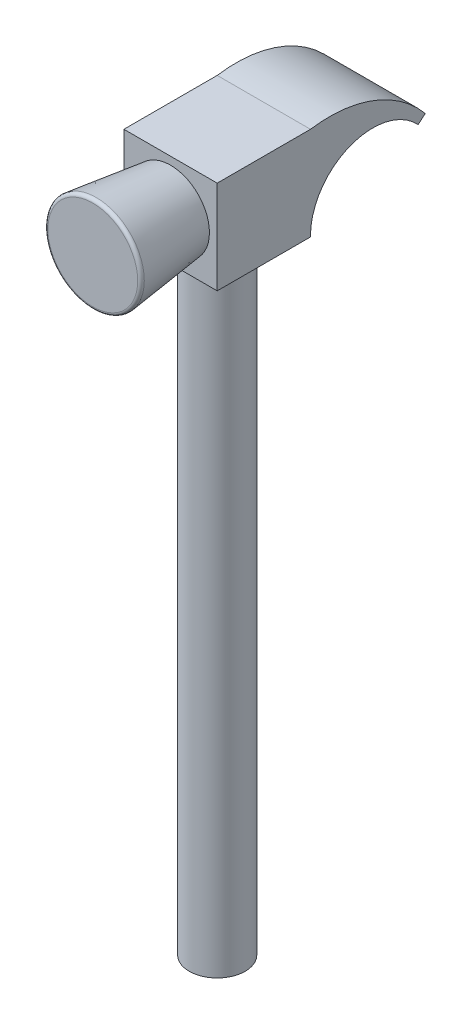
ISO-10303-21;
HEADER;
FILE_DESCRIPTION(('STEP AP214'),'2;1');
FILE_NAME('part.step','',(''),(''),'','','');
FILE_SCHEMA(('AUTOMOTIVE_DESIGN { 1 0 10303 214 1 1 1 1 }'));
ENDSEC;
DATA;
#1=APPLICATION_CONTEXT('core data for automotive mechanical design processes');
#2=APPLICATION_PROTOCOL_DEFINITION('international standard','automotive_design',2000,#1);
#3=PRODUCT_CONTEXT('',#1,'mechanical');
#4=PRODUCT('Part','Part','',(#3));
#5=PRODUCT_RELATED_PRODUCT_CATEGORY('part','',(#4));
#6=PRODUCT_DEFINITION_FORMATION('','',#4);
#7=PRODUCT_DEFINITION_CONTEXT('part definition',#1,'design');
#8=PRODUCT_DEFINITION('design','',#6,#7);
#9=PRODUCT_DEFINITION_SHAPE('','',#8);
#10=(LENGTH_UNIT() NAMED_UNIT(*) SI_UNIT(.MILLI.,.METRE.));
#11=(NAMED_UNIT(*) PLANE_ANGLE_UNIT() SI_UNIT($,.RADIAN.));
#12=(NAMED_UNIT(*) SI_UNIT($,.STERADIAN.) SOLID_ANGLE_UNIT());
#13=UNCERTAINTY_MEASURE_WITH_UNIT(LENGTH_MEASURE(1.E-05),#10,'distance_accuracy_value','');
#14=(GEOMETRIC_REPRESENTATION_CONTEXT(3) GLOBAL_UNCERTAINTY_ASSIGNED_CONTEXT((#13)) GLOBAL_UNIT_ASSIGNED_CONTEXT((#10,
#11,#12)) REPRESENTATION_CONTEXT('',''));
#15=CARTESIAN_POINT('',(0.,0.,0.));
#16=DIRECTION('',(0.,0.,1.));
#17=DIRECTION('',(1.,0.,0.));
#18=AXIS2_PLACEMENT_3D('',#15,#16,#17);
#19=CARTESIAN_POINT('',(0.,200.,0.));
#20=DIRECTION('',(0.,-1.,0.));
#21=DIRECTION('',(0.,0.,-1.));
#22=AXIS2_PLACEMENT_3D('',#19,#20,#21);
#23=CYLINDRICAL_SURFACE('',#22,9.);
#24=CARTESIAN_POINT('',(0.,200.,0.));
#25=DIRECTION('',(0.,1.,0.));
#26=DIRECTION('',(0.,0.,1.));
#27=AXIS2_PLACEMENT_3D('',#24,#25,#26);
#28=CIRCLE('',#27,9.);
#29=CARTESIAN_POINT('',(0.,200.,9.));
#30=VERTEX_POINT('',#29);
#31=EDGE_CURVE('E133',#30,#30,#28,.T.);
#32=ORIENTED_EDGE('',*,*,#31,.F.);
#33=EDGE_LOOP('',(#32));
#34=FACE_BOUND('',#33,.T.);
#35=CARTESIAN_POINT('',(0.,0.,0.));
#36=DIRECTION('',(0.,1.,0.));
#37=DIRECTION('',(0.,0.,1.));
#38=AXIS2_PLACEMENT_3D('',#35,#36,#37);
#39=CIRCLE('',#38,9.);
#40=CARTESIAN_POINT('',(0.,0.,9.));
#41=VERTEX_POINT('',#40);
#42=EDGE_CURVE('E132',#41,#41,#39,.T.);
#43=ORIENTED_EDGE('',*,*,#42,.T.);
#44=EDGE_LOOP('',(#43));
#45=FACE_BOUND('',#44,.T.);
#46=ADVANCED_FACE('F41',(#34,#45),#23,.T.);
#47=CARTESIAN_POINT('',(0.,0.,0.));
#48=DIRECTION('',(0.,1.,0.));
#49=DIRECTION('',(0.,0.,1.));
#50=AXIS2_PLACEMENT_3D('',#47,#48,#49);
#51=PLANE('',#50);
#52=ORIENTED_EDGE('',*,*,#42,.F.);
#53=EDGE_LOOP('',(#52));
#54=FACE_BOUND('',#53,.T.);
#55=ADVANCED_FACE('F227',(#54),#51,.F.);
#56=CARTESIAN_POINT('',(15.,230.,15.));
#57=DIRECTION('',(-1.,0.,0.));
#58=DIRECTION('',(0.,0.,1.));
#59=AXIS2_PLACEMENT_3D('',#56,#57,#58);
#60=PLANE('',#59);
#61=DIRECTION('',(0.,0.,-1.));
#62=VECTOR('',#61,1.);
#63=CARTESIAN_POINT('',(15.,200.,15.));
#64=LINE('',#63,#62);
#65=CARTESIAN_POINT('',(15.,200.,15.));
#66=VERTEX_POINT('',#65);
#67=CARTESIAN_POINT('',(15.,200.,-15.));
#68=VERTEX_POINT('',#67);
#69=EDGE_CURVE('E103',#66,#68,#64,.T.);
#70=ORIENTED_EDGE('',*,*,#69,.T.);
#71=DIRECTION('',(0.,-1.,0.));
#72=VECTOR('',#71,1.);
#73=CARTESIAN_POINT('',(15.,230.,-15.));
#74=LINE('',#73,#72);
#75=CARTESIAN_POINT('',(15.,200.717559848304,-15.));
#76=VERTEX_POINT('',#75);
#77=EDGE_CURVE('E129',#76,#68,#74,.T.);
#78=ORIENTED_EDGE('',*,*,#77,.F.);
#79=CARTESIAN_POINT('',(15.,200.358779924152,-34.9967816652087));
#80=DIRECTION('',(1.,0.,0.));
#81=DIRECTION('',(0.,0.,-1.));
#82=AXIS2_PLACEMENT_3D('',#79,#80,#81);
#83=CIRCLE('',#82,20.);
#84=CARTESIAN_POINT('',(15.,214.004396393402,-49.6185856296354));
#85=VERTEX_POINT('',#84);
#86=EDGE_CURVE('E57',#85,#76,#83,.T.);
#87=ORIENTED_EDGE('',*,*,#86,.F.);
#88=DIRECTION('',(0.,-0.642787609686542,0.766044443118976));
#89=VECTOR('',#88,1.);
#90=CARTESIAN_POINT('',(15.,101.150551009131,84.8753900451407));
#91=LINE('',#90,#89);
#92=CARTESIAN_POINT('',(15.,215.932759222462,-51.9167189589923));
#93=VERTEX_POINT('',#92);
#94=EDGE_CURVE('E179',#93,#85,#91,.T.);
#95=ORIENTED_EDGE('',*,*,#94,.F.);
#96=CARTESIAN_POINT('',(15.,190.490560218525,-21.0833385207669));
#97=DIRECTION('',(1.,0.,0.));
#98=DIRECTION('',(0.,0.,-1.));
#99=AXIS2_PLACEMENT_3D('',#96,#97,#98);
#100=CIRCLE('',#99,39.9750276973546);
#101=CARTESIAN_POINT('',(15.,230.,-15.));
#102=VERTEX_POINT('',#101);
#103=EDGE_CURVE('E192',#102,#93,#100,.F.);
#104=ORIENTED_EDGE('',*,*,#103,.F.);
#105=DIRECTION('',(0.,0.,-1.));
#106=VECTOR('',#105,1.);
#107=CARTESIAN_POINT('',(15.,230.,15.));
#108=LINE('',#107,#106);
#109=CARTESIAN_POINT('',(15.,230.,15.));
#110=VERTEX_POINT('',#109);
#111=EDGE_CURVE('E96',#110,#102,#108,.T.);
#112=ORIENTED_EDGE('',*,*,#111,.F.);
#113=DIRECTION('',(0.,-1.,0.));
#114=VECTOR('',#113,1.);
#115=CARTESIAN_POINT('',(15.,230.,15.));
#116=LINE('',#115,#114);
#117=EDGE_CURVE('E88',#110,#66,#116,.T.);
#118=ORIENTED_EDGE('',*,*,#117,.T.);
#119=EDGE_LOOP('',(#70,#78,#87,#95,#104,#112,#118));
#120=FACE_BOUND('',#119,.T.);
#121=ADVANCED_FACE('F101',(#120),#60,.F.);
#122=CARTESIAN_POINT('',(-15.,230.,-15.));
#123=DIRECTION('',(0.,0.,1.));
#124=DIRECTION('',(1.,0.,0.));
#125=AXIS2_PLACEMENT_3D('',#122,#123,#124);
#126=PLANE('',#125);
#127=DIRECTION('',(0.,-1.,0.));
#128=VECTOR('',#127,1.);
#129=CARTESIAN_POINT('',(-15.,230.,-15.));
#130=LINE('',#129,#128);
#131=CARTESIAN_POINT('',(-15.,200.717559848304,-15.));
#132=VERTEX_POINT('',#131);
#133=CARTESIAN_POINT('',(-15.,200.,-15.));
#134=VERTEX_POINT('',#133);
#135=EDGE_CURVE('E126',#132,#134,#130,.T.);
#136=ORIENTED_EDGE('',*,*,#135,.F.);
#137=DIRECTION('',(1.,0.,0.));
#138=VECTOR('',#137,1.);
#139=CARTESIAN_POINT('',(-15.,200.717559848304,-15.));
#140=LINE('',#139,#138);
#141=EDGE_CURVE('E112',#132,#76,#140,.T.);
#142=ORIENTED_EDGE('',*,*,#141,.T.);
#143=ORIENTED_EDGE('',*,*,#77,.T.);
#144=DIRECTION('',(-1.,0.,0.));
#145=VECTOR('',#144,1.);
#146=CARTESIAN_POINT('',(-15.,200.,-15.));
#147=LINE('',#146,#145);
#148=EDGE_CURVE('E110',#68,#134,#147,.T.);
#149=ORIENTED_EDGE('',*,*,#148,.T.);
#150=EDGE_LOOP('',(#136,#142,#143,#149));
#151=FACE_BOUND('',#150,.T.);
#152=ADVANCED_FACE('F174',(#151),#126,.F.);
#153=CARTESIAN_POINT('',(-15.,230.,15.));
#154=DIRECTION('',(1.,0.,0.));
#155=DIRECTION('',(0.,0.,-1.));
#156=AXIS2_PLACEMENT_3D('',#153,#154,#155);
#157=PLANE('',#156);
#158=DIRECTION('',(0.,0.,1.));
#159=VECTOR('',#158,1.);
#160=CARTESIAN_POINT('',(-15.,200.,15.));
#161=LINE('',#160,#159);
#162=CARTESIAN_POINT('',(-15.,200.,15.));
#163=VERTEX_POINT('',#162);
#164=EDGE_CURVE('E97',#134,#163,#161,.T.);
#165=ORIENTED_EDGE('',*,*,#164,.T.);
#166=DIRECTION('',(0.,-1.,0.));
#167=VECTOR('',#166,1.);
#168=CARTESIAN_POINT('',(-15.,230.,15.));
#169=LINE('',#168,#167);
#170=CARTESIAN_POINT('',(-15.,230.,15.));
#171=VERTEX_POINT('',#170);
#172=EDGE_CURVE('E91',#171,#163,#169,.T.);
#173=ORIENTED_EDGE('',*,*,#172,.F.);
#174=DIRECTION('',(0.,0.,1.));
#175=VECTOR('',#174,1.);
#176=CARTESIAN_POINT('',(-15.,230.,15.));
#177=LINE('',#176,#175);
#178=CARTESIAN_POINT('',(-15.,230.,-15.));
#179=VERTEX_POINT('',#178);
#180=EDGE_CURVE('E158',#179,#171,#177,.T.);
#181=ORIENTED_EDGE('',*,*,#180,.F.);
#182=CARTESIAN_POINT('',(-15.,190.490560218525,-21.0833385207669));
#183=DIRECTION('',(1.,0.,0.));
#184=DIRECTION('',(0.,0.,-1.));
#185=AXIS2_PLACEMENT_3D('',#182,#183,#184);
#186=CIRCLE('',#185,39.9750276973546);
#187=CARTESIAN_POINT('',(-15.,215.932759222462,-51.9167189589923));
#188=VERTEX_POINT('',#187);
#189=EDGE_CURVE('E202',#179,#188,#186,.F.);
#190=ORIENTED_EDGE('',*,*,#189,.T.);
#191=DIRECTION('',(0.,-0.642787609686542,0.766044443118976));
#192=VECTOR('',#191,1.);
#193=CARTESIAN_POINT('',(-15.,101.150551009131,84.8753900451407));
#194=LINE('',#193,#192);
#195=CARTESIAN_POINT('',(-15.,214.004396393402,-49.6185856296354));
#196=VERTEX_POINT('',#195);
#197=EDGE_CURVE('E199',#188,#196,#194,.T.);
#198=ORIENTED_EDGE('',*,*,#197,.T.);
#199=CARTESIAN_POINT('',(-15.,200.358779924152,-34.9967816652087));
#200=DIRECTION('',(1.,0.,0.));
#201=DIRECTION('',(0.,0.,-1.));
#202=AXIS2_PLACEMENT_3D('',#199,#200,#201);
#203=CIRCLE('',#202,20.);
#204=EDGE_CURVE('E172',#196,#132,#203,.T.);
#205=ORIENTED_EDGE('',*,*,#204,.T.);
#206=ORIENTED_EDGE('',*,*,#135,.T.);
#207=EDGE_LOOP('',(#165,#173,#181,#190,#198,#205,#206));
#208=FACE_BOUND('',#207,.T.);
#209=ADVANCED_FACE('F167',(#208),#157,.F.);
#210=CARTESIAN_POINT('',(-15.,230.,15.));
#211=DIRECTION('',(0.,0.,-1.));
#212=DIRECTION('',(-1.,0.,0.));
#213=AXIS2_PLACEMENT_3D('',#210,#211,#212);
#214=PLANE('',#213);
#215=CARTESIAN_POINT('',(0.,215.,15.));
#216=DIRECTION('',(0.,0.,1.));
#217=DIRECTION('',(1.,0.,0.));
#218=AXIS2_PLACEMENT_3D('',#215,#216,#217);
#219=CIRCLE('',#218,12.5);
#220=CARTESIAN_POINT('',(12.5,215.,15.));
#221=VERTEX_POINT('',#220);
#222=EDGE_CURVE('E137',#221,#221,#219,.T.);
#223=ORIENTED_EDGE('',*,*,#222,.F.);
#224=EDGE_LOOP('',(#223));
#225=FACE_BOUND('',#224,.T.);
#226=DIRECTION('',(1.,0.,0.));
#227=VECTOR('',#226,1.);
#228=CARTESIAN_POINT('',(-15.,200.,15.));
#229=LINE('',#228,#227);
#230=EDGE_CURVE('E85',#163,#66,#229,.T.);
#231=ORIENTED_EDGE('',*,*,#230,.T.);
#232=ORIENTED_EDGE('',*,*,#117,.F.);
#233=DIRECTION('',(1.,0.,0.));
#234=VECTOR('',#233,1.);
#235=CARTESIAN_POINT('',(-15.,230.,15.));
#236=LINE('',#235,#234);
#237=EDGE_CURVE('E66',#171,#110,#236,.T.);
#238=ORIENTED_EDGE('',*,*,#237,.F.);
#239=ORIENTED_EDGE('',*,*,#172,.T.);
#240=EDGE_LOOP('',(#231,#232,#238,#239));
#241=FACE_BOUND('',#240,.T.);
#242=ADVANCED_FACE('F87',(#225,#241),#214,.F.);
#243=CARTESIAN_POINT('',(0.,230.,0.));
#244=DIRECTION('',(0.,-1.,0.));
#245=DIRECTION('',(0.,0.,-1.));
#246=AXIS2_PLACEMENT_3D('',#243,#244,#245);
#247=PLANE('',#246);
#248=ORIENTED_EDGE('',*,*,#111,.T.);
#249=DIRECTION('',(-1.,0.,0.));
#250=VECTOR('',#249,1.);
#251=CARTESIAN_POINT('',(-15.,230.,-15.));
#252=LINE('',#251,#250);
#253=EDGE_CURVE('E155',#102,#179,#252,.T.);
#254=ORIENTED_EDGE('',*,*,#253,.T.);
#255=ORIENTED_EDGE('',*,*,#180,.T.);
#256=ORIENTED_EDGE('',*,*,#237,.T.);
#257=EDGE_LOOP('',(#248,#254,#255,#256));
#258=FACE_BOUND('',#257,.T.);
#259=ADVANCED_FACE('F162',(#258),#247,.F.);
#260=CARTESIAN_POINT('',(0.,200.,0.));
#261=DIRECTION('',(0.,-1.,0.));
#262=DIRECTION('',(0.,0.,-1.));
#263=AXIS2_PLACEMENT_3D('',#260,#261,#262);
#264=PLANE('',#263);
#265=ORIENTED_EDGE('',*,*,#31,.T.);
#266=EDGE_LOOP('',(#265));
#267=FACE_BOUND('',#266,.T.);
#268=ORIENTED_EDGE('',*,*,#69,.F.);
#269=ORIENTED_EDGE('',*,*,#230,.F.);
#270=ORIENTED_EDGE('',*,*,#164,.F.);
#271=ORIENTED_EDGE('',*,*,#148,.F.);
#272=EDGE_LOOP('',(#268,#269,#270,#271));
#273=FACE_BOUND('',#272,.T.);
#274=ADVANCED_FACE('F108',(#267,#273),#264,.T.);
#275=CARTESIAN_POINT('',(0.,215.,15.));
#276=DIRECTION('',(0.,0.,1.));
#277=DIRECTION('',(1.,0.,0.));
#278=AXIS2_PLACEMENT_3D('',#275,#276,#277);
#279=CONICAL_SURFACE('',#278,12.5,0.122173047639603);
#280=CARTESIAN_POINT('',(0.,215.,38.8781306565948));
#281=DIRECTION('',(0.,0.,1.));
#282=DIRECTION('',(1.,0.,0.));
#283=AXIS2_PLACEMENT_3D('',#280,#281,#282);
#284=CIRCLE('',#283,15.4318657878522);
#285=CARTESIAN_POINT('',(15.4318657878522,215.,38.8781306565948));
#286=VERTEX_POINT('',#285);
#287=EDGE_CURVE('E11',#286,#286,#284,.F.);
#288=ORIENTED_EDGE('',*,*,#287,.T.);
#289=EDGE_LOOP('',(#288));
#290=FACE_BOUND('',#289,.T.);
#291=ORIENTED_EDGE('',*,*,#222,.T.);
#292=EDGE_LOOP('',(#291));
#293=FACE_BOUND('',#292,.T.);
#294=ADVANCED_FACE('F248',(#290,#293),#279,.T.);
#295=CARTESIAN_POINT('',(0.,215.,40.));
#296=DIRECTION('',(0.,0.,1.));
#297=DIRECTION('',(1.,0.,0.));
#298=AXIS2_PLACEMENT_3D('',#295,#296,#297);
#299=PLANE('',#298);
#300=CARTESIAN_POINT('',(0.,215.,40.));
#301=DIRECTION('',(0.,0.,1.));
#302=DIRECTION('',(1.,0.,0.));
#303=AXIS2_PLACEMENT_3D('',#300,#301,#302);
#304=CIRCLE('',#303,14.4393196362109);
#305=CARTESIAN_POINT('',(14.4393196362109,215.,40.));
#306=VERTEX_POINT('',#305);
#307=EDGE_CURVE('E50',#306,#306,#304,.T.);
#308=ORIENTED_EDGE('',*,*,#307,.T.);
#309=EDGE_LOOP('',(#308));
#310=FACE_BOUND('',#309,.T.);
#311=ADVANCED_FACE('F224',(#310),#299,.T.);
#312=CARTESIAN_POINT('',(-15.,200.358779924152,-34.9967816652087));
#313=DIRECTION('',(1.,0.,0.));
#314=DIRECTION('',(0.,0.,-1.));
#315=AXIS2_PLACEMENT_3D('',#312,#313,#314);
#316=CYLINDRICAL_SURFACE('',#315,20.);
#317=DIRECTION('',(1.,0.,0.));
#318=VECTOR('',#317,1.);
#319=CARTESIAN_POINT('',(-15.,214.004396393402,-49.6185856296354));
#320=LINE('',#319,#318);
#321=EDGE_CURVE('E151',#196,#85,#320,.T.);
#322=ORIENTED_EDGE('',*,*,#321,.T.);
#323=ORIENTED_EDGE('',*,*,#86,.T.);
#324=ORIENTED_EDGE('',*,*,#141,.F.);
#325=ORIENTED_EDGE('',*,*,#204,.F.);
#326=EDGE_LOOP('',(#322,#323,#324,#325));
#327=FACE_BOUND('',#326,.T.);
#328=ADVANCED_FACE('F206',(#327),#316,.F.);
#329=CARTESIAN_POINT('',(-15.,190.490560218525,-21.0833385207669));
#330=DIRECTION('',(1.,0.,0.));
#331=DIRECTION('',(0.,0.,-1.));
#332=AXIS2_PLACEMENT_3D('',#329,#330,#331);
#333=CYLINDRICAL_SURFACE('',#332,39.9750276973546);
#334=ORIENTED_EDGE('',*,*,#253,.F.);
#335=ORIENTED_EDGE('',*,*,#103,.T.);
#336=DIRECTION('',(1.,0.,0.));
#337=VECTOR('',#336,1.);
#338=CARTESIAN_POINT('',(-15.,215.932759222462,-51.9167189589923));
#339=LINE('',#338,#337);
#340=EDGE_CURVE('E117',#188,#93,#339,.T.);
#341=ORIENTED_EDGE('',*,*,#340,.F.);
#342=ORIENTED_EDGE('',*,*,#189,.F.);
#343=EDGE_LOOP('',(#334,#335,#341,#342));
#344=FACE_BOUND('',#343,.T.);
#345=ADVANCED_FACE('F216',(#344),#333,.T.);
#346=CARTESIAN_POINT('',(-15.,101.150551009131,84.8753900451407));
#347=DIRECTION('',(0.,0.766044443118976,0.642787609686542));
#348=DIRECTION('',(0.,-0.642787609686542,0.766044443118976));
#349=AXIS2_PLACEMENT_3D('',#346,#347,#348);
#350=PLANE('',#349);
#351=ORIENTED_EDGE('',*,*,#340,.T.);
#352=ORIENTED_EDGE('',*,*,#94,.T.);
#353=ORIENTED_EDGE('',*,*,#321,.F.);
#354=ORIENTED_EDGE('',*,*,#197,.F.);
#355=EDGE_LOOP('',(#351,#352,#353,#354));
#356=FACE_BOUND('',#355,.T.);
#357=ADVANCED_FACE('F187',(#356),#350,.F.);
#358=CARTESIAN_POINT('',(0.,215.,39.));
#359=DIRECTION('',(0.,0.,1.));
#360=DIRECTION('',(1.,0.,0.));
#361=AXIS2_PLACEMENT_3D('',#358,#359,#360);
#362=TOROIDAL_SURFACE('',#361,14.4393196362109,1.);
#363=ORIENTED_EDGE('',*,*,#287,.F.);
#364=EDGE_LOOP('',(#363));
#365=FACE_BOUND('',#364,.T.);
#366=ORIENTED_EDGE('',*,*,#307,.F.);
#367=EDGE_LOOP('',(#366));
#368=FACE_BOUND('',#367,.T.);
#369=ADVANCED_FACE('F43',(#365,#368),#362,.T.);
#370=CLOSED_SHELL('',(#46,#55,#121,#152,#209,#242,#259,#274,#294,#311,#328,#345,#357,#369));
#371=MANIFOLD_SOLID_BREP('B2',#370);
#372=ADVANCED_BREP_SHAPE_REPRESENTATION('',(#18,#371),#14);
#373=SHAPE_DEFINITION_REPRESENTATION(#9,#372);
ENDSEC;
END-ISO-10303-21;
